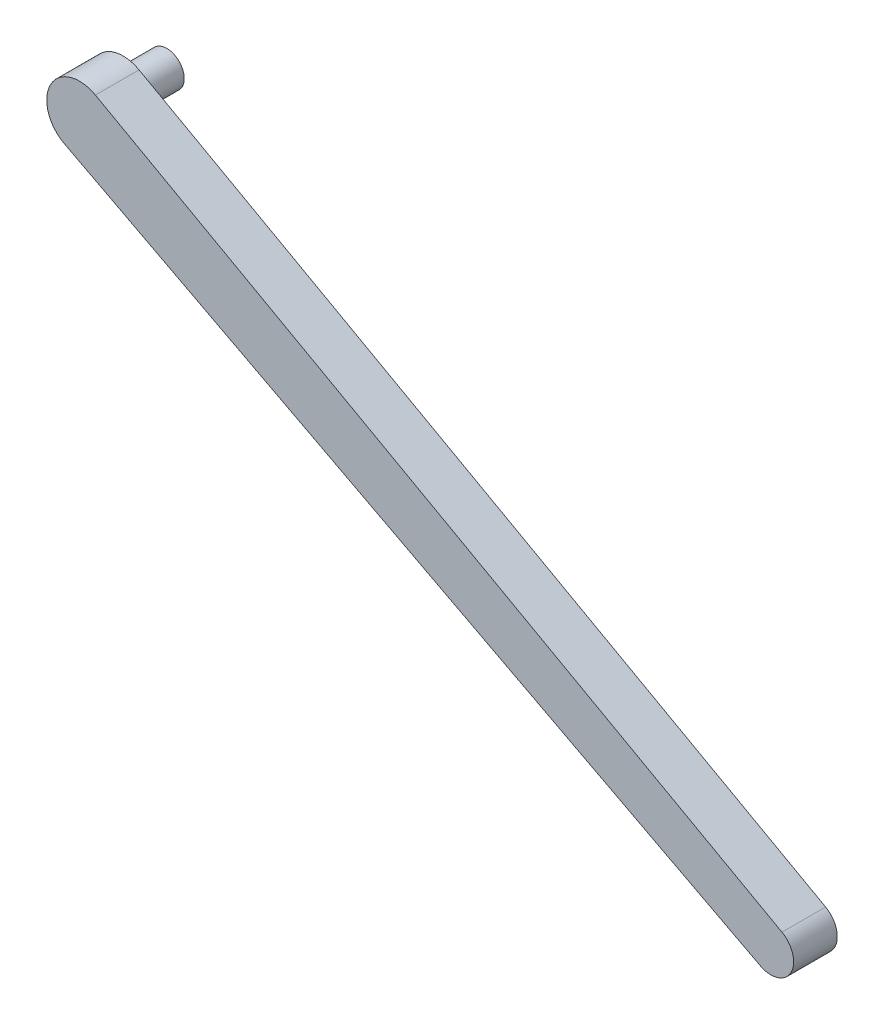
ISO-10303-21;
HEADER;
FILE_DESCRIPTION(('STEP AP214'),'2;1');
FILE_NAME('part.step','',(''),(''),'','','');
FILE_SCHEMA(('AUTOMOTIVE_DESIGN { 1 0 10303 214 1 1 1 1 }'));
ENDSEC;
DATA;
#1=APPLICATION_CONTEXT('core data for automotive mechanical design processes');
#2=APPLICATION_PROTOCOL_DEFINITION('international standard','automotive_design',2000,#1);
#3=PRODUCT_CONTEXT('',#1,'mechanical');
#4=PRODUCT('Part','Part','',(#3));
#5=PRODUCT_RELATED_PRODUCT_CATEGORY('part','',(#4));
#6=PRODUCT_DEFINITION_FORMATION('','',#4);
#7=PRODUCT_DEFINITION_CONTEXT('part definition',#1,'design');
#8=PRODUCT_DEFINITION('design','',#6,#7);
#9=PRODUCT_DEFINITION_SHAPE('','',#8);
#10=(LENGTH_UNIT() NAMED_UNIT(*) SI_UNIT(.MILLI.,.METRE.));
#11=(NAMED_UNIT(*) PLANE_ANGLE_UNIT() SI_UNIT($,.RADIAN.));
#12=(NAMED_UNIT(*) SI_UNIT($,.STERADIAN.) SOLID_ANGLE_UNIT());
#13=UNCERTAINTY_MEASURE_WITH_UNIT(LENGTH_MEASURE(1.E-05),#10,'distance_accuracy_value','');
#14=(GEOMETRIC_REPRESENTATION_CONTEXT(3) GLOBAL_UNCERTAINTY_ASSIGNED_CONTEXT((#13)) GLOBAL_UNIT_ASSIGNED_CONTEXT((#10,
#11,#12)) REPRESENTATION_CONTEXT('',''));
#15=CARTESIAN_POINT('',(0.,0.,0.));
#16=DIRECTION('',(0.,0.,1.));
#17=DIRECTION('',(1.,0.,0.));
#18=AXIS2_PLACEMENT_3D('',#15,#16,#17);
#19=CARTESIAN_POINT('',(0.,0.,0.));
#20=DIRECTION('',(0.,0.,1.));
#21=DIRECTION('',(1.,0.,0.));
#22=AXIS2_PLACEMENT_3D('',#19,#20,#21);
#23=PLANE('',#22);
#24=DIRECTION('',(0.874031845170728,-0.485868638242327,0.));
#25=VECTOR('',#24,1.);
#26=CARTESIAN_POINT('',(-43.5696519386731,-78.3776936399255,0.));
#27=LINE('',#26,#25);
#28=CARTESIAN_POINT('',(-196.355985213183,6.55523883878045,0.));
#29=VERTEX_POINT('',#28);
#30=CARTESIAN_POINT('',(-39.0430632462077,-80.8939949578273,0.));
#31=VERTEX_POINT('',#30);
#32=EDGE_CURVE('E101',#29,#31,#27,.T.);
#33=ORIENTED_EDGE('',*,*,#32,.T.);
#34=CARTESIAN_POINT('',(-41.5710502933571,-85.441605174821,0.));
#35=DIRECTION('',(0.,0.,1.));
#36=DIRECTION('',(1.,0.,0.));
#37=AXIS2_PLACEMENT_3D('',#34,#35,#36);
#38=CIRCLE('',#37,5.20302577316901);
#39=CARTESIAN_POINT('',(-43.9821596482325,-90.0522481749993,0.));
#40=VERTEX_POINT('',#39);
#41=EDGE_CURVE('E107',#40,#31,#38,.T.);
#42=ORIENTED_EDGE('',*,*,#41,.F.);
#43=DIRECTION('',(0.886146484984656,-0.463405229954668,0.));
#44=VECTOR('',#43,1.);
#45=CARTESIAN_POINT('',(-46.4244206545278,-88.775081766952,0.));
#46=LINE('',#45,#44);
#47=CARTESIAN_POINT('',(-203.47553922466,-6.64609863738495,0.));
#48=VERTEX_POINT('',#47);
#49=EDGE_CURVE('E69',#48,#40,#46,.T.);
#50=ORIENTED_EDGE('',*,*,#49,.F.);
#51=CARTESIAN_POINT('',(-200.,0.,0.));
#52=DIRECTION('',(0.,0.,1.));
#53=DIRECTION('',(1.,0.,0.));
#54=AXIS2_PLACEMENT_3D('',#51,#52,#53);
#55=CIRCLE('',#54,7.50000000000001);
#56=EDGE_CURVE('E93',#29,#48,#55,.T.);
#57=ORIENTED_EDGE('',*,*,#56,.F.);
#58=EDGE_LOOP('',(#33,#42,#50,#57));
#59=FACE_BOUND('',#58,.T.);
#60=CARTESIAN_POINT('',(-200.,0.,0.));
#61=DIRECTION('',(0.,0.,1.));
#62=DIRECTION('',(1.,0.,0.));
#63=AXIS2_PLACEMENT_3D('',#60,#61,#62);
#64=CIRCLE('',#63,3.99999999999999);
#65=CARTESIAN_POINT('',(-196.,0.,0.));
#66=VERTEX_POINT('',#65);
#67=EDGE_CURVE('E11',#66,#66,#64,.F.);
#68=ORIENTED_EDGE('',*,*,#67,.F.);
#69=EDGE_LOOP('',(#68));
#70=FACE_BOUND('',#69,.T.);
#71=ADVANCED_FACE('F35',(#59,#70),#23,.F.);
#72=CARTESIAN_POINT('',(-43.5696519386731,-78.3776936399255,10.));
#73=DIRECTION('',(0.485868638242327,0.874031845170728,0.));
#74=DIRECTION('',(-0.874031845170728,0.485868638242327,0.));
#75=AXIS2_PLACEMENT_3D('',#72,#73,#74);
#76=PLANE('',#75);
#77=ORIENTED_EDGE('',*,*,#32,.F.);
#78=DIRECTION('',(0.,0.,-1.));
#79=VECTOR('',#78,1.);
#80=CARTESIAN_POINT('',(-196.355985213183,6.55523883878045,10.));
#81=LINE('',#80,#79);
#82=CARTESIAN_POINT('',(-196.355985213183,6.55523883878045,10.));
#83=VERTEX_POINT('',#82);
#84=EDGE_CURVE('E44',#83,#29,#81,.T.);
#85=ORIENTED_EDGE('',*,*,#84,.F.);
#86=DIRECTION('',(0.874031845170728,-0.485868638242327,0.));
#87=VECTOR('',#86,1.);
#88=CARTESIAN_POINT('',(-43.5696519386731,-78.3776936399255,10.));
#89=LINE('',#88,#87);
#90=CARTESIAN_POINT('',(-39.0430632462077,-80.8939949578273,10.));
#91=VERTEX_POINT('',#90);
#92=EDGE_CURVE('E87',#83,#91,#89,.T.);
#93=ORIENTED_EDGE('',*,*,#92,.T.);
#94=DIRECTION('',(0.,0.,-1.));
#95=VECTOR('',#94,1.);
#96=CARTESIAN_POINT('',(-39.0430632462077,-80.8939949578273,10.));
#97=LINE('',#96,#95);
#98=EDGE_CURVE('E76',#91,#31,#97,.T.);
#99=ORIENTED_EDGE('',*,*,#98,.T.);
#100=EDGE_LOOP('',(#77,#85,#93,#99));
#101=FACE_BOUND('',#100,.T.);
#102=ADVANCED_FACE('F37',(#101),#76,.T.);
#103=CARTESIAN_POINT('',(-200.,0.,10.));
#104=DIRECTION('',(0.,0.,-1.));
#105=DIRECTION('',(-1.,0.,0.));
#106=AXIS2_PLACEMENT_3D('',#103,#104,#105);
#107=CYLINDRICAL_SURFACE('',#106,7.50000000000001);
#108=ORIENTED_EDGE('',*,*,#56,.T.);
#109=DIRECTION('',(0.,0.,-1.));
#110=VECTOR('',#109,1.);
#111=CARTESIAN_POINT('',(-203.47553922466,-6.64609863738495,10.));
#112=LINE('',#111,#110);
#113=CARTESIAN_POINT('',(-203.47553922466,-6.64609863738495,10.));
#114=VERTEX_POINT('',#113);
#115=EDGE_CURVE('E90',#114,#48,#112,.T.);
#116=ORIENTED_EDGE('',*,*,#115,.F.);
#117=CARTESIAN_POINT('',(-200.,0.,10.));
#118=DIRECTION('',(0.,0.,1.));
#119=DIRECTION('',(1.,0.,0.));
#120=AXIS2_PLACEMENT_3D('',#117,#118,#119);
#121=CIRCLE('',#120,7.50000000000001);
#122=EDGE_CURVE('E82',#83,#114,#121,.T.);
#123=ORIENTED_EDGE('',*,*,#122,.F.);
#124=ORIENTED_EDGE('',*,*,#84,.T.);
#125=EDGE_LOOP('',(#108,#116,#123,#124));
#126=FACE_BOUND('',#125,.T.);
#127=ADVANCED_FACE('F91',(#126),#107,.T.);
#128=CARTESIAN_POINT('',(-46.4244206545278,-88.775081766952,10.));
#129=DIRECTION('',(0.463405229954668,0.886146484984656,0.));
#130=DIRECTION('',(-0.886146484984656,0.463405229954668,0.));
#131=AXIS2_PLACEMENT_3D('',#128,#129,#130);
#132=PLANE('',#131);
#133=ORIENTED_EDGE('',*,*,#49,.T.);
#134=DIRECTION('',(0.,0.,-1.));
#135=VECTOR('',#134,1.);
#136=CARTESIAN_POINT('',(-43.9821596482325,-90.0522481749993,10.));
#137=LINE('',#136,#135);
#138=CARTESIAN_POINT('',(-43.9821596482325,-90.0522481749993,10.));
#139=VERTEX_POINT('',#138);
#140=EDGE_CURVE('E94',#139,#40,#137,.T.);
#141=ORIENTED_EDGE('',*,*,#140,.F.);
#142=DIRECTION('',(0.886146484984656,-0.463405229954668,0.));
#143=VECTOR('',#142,1.);
#144=CARTESIAN_POINT('',(-46.4244206545278,-88.775081766952,10.));
#145=LINE('',#144,#143);
#146=EDGE_CURVE('E86',#114,#139,#145,.T.);
#147=ORIENTED_EDGE('',*,*,#146,.F.);
#148=ORIENTED_EDGE('',*,*,#115,.T.);
#149=EDGE_LOOP('',(#133,#141,#147,#148));
#150=FACE_BOUND('',#149,.T.);
#151=ADVANCED_FACE('F96',(#150),#132,.F.);
#152=CARTESIAN_POINT('',(-41.5710502933571,-85.441605174821,10.));
#153=DIRECTION('',(0.,0.,-1.));
#154=DIRECTION('',(-1.,0.,0.));
#155=AXIS2_PLACEMENT_3D('',#152,#153,#154);
#156=CYLINDRICAL_SURFACE('',#155,5.20302577316901);
#157=ORIENTED_EDGE('',*,*,#41,.T.);
#158=ORIENTED_EDGE('',*,*,#98,.F.);
#159=CARTESIAN_POINT('',(-41.5710502933571,-85.441605174821,10.));
#160=DIRECTION('',(0.,0.,1.));
#161=DIRECTION('',(1.,0.,0.));
#162=AXIS2_PLACEMENT_3D('',#159,#160,#161);
#163=CIRCLE('',#162,5.20302577316901);
#164=EDGE_CURVE('E52',#139,#91,#163,.T.);
#165=ORIENTED_EDGE('',*,*,#164,.F.);
#166=ORIENTED_EDGE('',*,*,#140,.T.);
#167=EDGE_LOOP('',(#157,#158,#165,#166));
#168=FACE_BOUND('',#167,.T.);
#169=ADVANCED_FACE('F124',(#168),#156,.T.);
#170=CARTESIAN_POINT('',(0.,0.,10.));
#171=DIRECTION('',(0.,0.,1.));
#172=DIRECTION('',(1.,0.,0.));
#173=AXIS2_PLACEMENT_3D('',#170,#171,#172);
#174=PLANE('',#173);
#175=ORIENTED_EDGE('',*,*,#92,.F.);
#176=ORIENTED_EDGE('',*,*,#122,.T.);
#177=ORIENTED_EDGE('',*,*,#146,.T.);
#178=ORIENTED_EDGE('',*,*,#164,.T.);
#179=EDGE_LOOP('',(#175,#176,#177,#178));
#180=FACE_BOUND('',#179,.T.);
#181=ADVANCED_FACE('F84',(#180),#174,.T.);
#182=CARTESIAN_POINT('',(-200.,0.,-10.));
#183=DIRECTION('',(0.,0.,1.));
#184=DIRECTION('',(1.,0.,0.));
#185=AXIS2_PLACEMENT_3D('',#182,#183,#184);
#186=CYLINDRICAL_SURFACE('',#185,3.99999999999999);
#187=CARTESIAN_POINT('',(-200.,0.,-10.));
#188=DIRECTION('',(0.,0.,-1.));
#189=DIRECTION('',(-1.,0.,0.));
#190=AXIS2_PLACEMENT_3D('',#187,#188,#189);
#191=CIRCLE('',#190,3.99999999999999);
#192=CARTESIAN_POINT('',(-204.,0.,-10.));
#193=VERTEX_POINT('',#192);
#194=EDGE_CURVE('E104',#193,#193,#191,.T.);
#195=ORIENTED_EDGE('',*,*,#194,.F.);
#196=EDGE_LOOP('',(#195));
#197=FACE_BOUND('',#196,.T.);
#198=ORIENTED_EDGE('',*,*,#67,.T.);
#199=EDGE_LOOP('',(#198));
#200=FACE_BOUND('',#199,.T.);
#201=ADVANCED_FACE('F146',(#197,#200),#186,.T.);
#202=CARTESIAN_POINT('',(-200.,0.,-10.));
#203=DIRECTION('',(0.,0.,-1.));
#204=DIRECTION('',(-1.,0.,0.));
#205=AXIS2_PLACEMENT_3D('',#202,#203,#204);
#206=PLANE('',#205);
#207=ORIENTED_EDGE('',*,*,#194,.T.);
#208=EDGE_LOOP('',(#207));
#209=FACE_BOUND('',#208,.T.);
#210=ADVANCED_FACE('F153',(#209),#206,.T.);
#211=CLOSED_SHELL('',(#71,#102,#127,#151,#169,#181,#201,#210));
#212=MANIFOLD_SOLID_BREP('B2',#211);
#213=ADVANCED_BREP_SHAPE_REPRESENTATION('',(#18,#212),#14);
#214=SHAPE_DEFINITION_REPRESENTATION(#9,#213);
ENDSEC;
END-ISO-10303-21;
